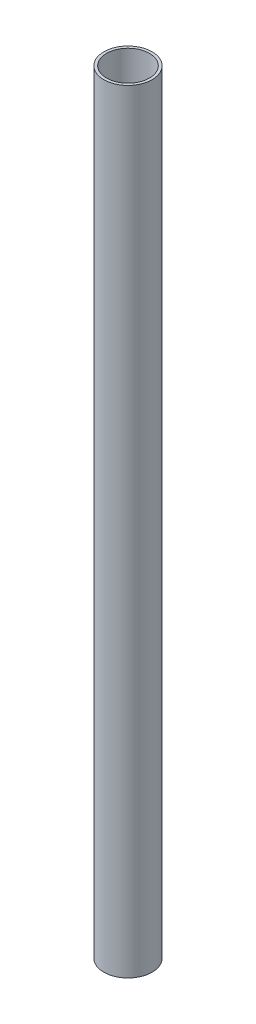
ISO-10303-21;
HEADER;
FILE_DESCRIPTION(('STEP AP214'),'2;1');
FILE_NAME('part.step','',(''),(''),'','','');
FILE_SCHEMA(('AUTOMOTIVE_DESIGN { 1 0 10303 214 1 1 1 1 }'));
ENDSEC;
DATA;
#1=APPLICATION_CONTEXT('core data for automotive mechanical design processes');
#2=APPLICATION_PROTOCOL_DEFINITION('international standard','automotive_design',2000,#1);
#3=PRODUCT_CONTEXT('',#1,'mechanical');
#4=PRODUCT('Part','Part','',(#3));
#5=PRODUCT_RELATED_PRODUCT_CATEGORY('part','',(#4));
#6=PRODUCT_DEFINITION_FORMATION('','',#4);
#7=PRODUCT_DEFINITION_CONTEXT('part definition',#1,'design');
#8=PRODUCT_DEFINITION('design','',#6,#7);
#9=PRODUCT_DEFINITION_SHAPE('','',#8);
#10=(LENGTH_UNIT() NAMED_UNIT(*) SI_UNIT(.MILLI.,.METRE.));
#11=(NAMED_UNIT(*) PLANE_ANGLE_UNIT() SI_UNIT($,.RADIAN.));
#12=(NAMED_UNIT(*) SI_UNIT($,.STERADIAN.) SOLID_ANGLE_UNIT());
#13=UNCERTAINTY_MEASURE_WITH_UNIT(LENGTH_MEASURE(1.E-05),#10,'distance_accuracy_value','');
#14=(GEOMETRIC_REPRESENTATION_CONTEXT(3) GLOBAL_UNCERTAINTY_ASSIGNED_CONTEXT((#13)) GLOBAL_UNIT_ASSIGNED_CONTEXT((#10,
#11,#12)) REPRESENTATION_CONTEXT('',''));
#15=CARTESIAN_POINT('',(0.,0.,0.));
#16=DIRECTION('',(0.,0.,1.));
#17=DIRECTION('',(1.,0.,0.));
#18=AXIS2_PLACEMENT_3D('',#15,#16,#17);
#19=CARTESIAN_POINT('',(0.,203.2,0.));
#20=DIRECTION('',(0.,1.,0.));
#21=DIRECTION('',(0.,0.,1.));
#22=AXIS2_PLACEMENT_3D('',#19,#20,#21);
#23=PLANE('',#22);
#24=CARTESIAN_POINT('',(0.,203.2,0.));
#25=DIRECTION('',(0.,1.,0.));
#26=DIRECTION('',(0.,0.,1.));
#27=AXIS2_PLACEMENT_3D('',#24,#25,#26);
#28=CIRCLE('',#27,6.35);
#29=CARTESIAN_POINT('',(0.,203.2,6.35));
#30=VERTEX_POINT('',#29);
#31=EDGE_CURVE('E10',#30,#30,#28,.T.);
#32=ORIENTED_EDGE('',*,*,#31,.T.);
#33=EDGE_LOOP('',(#32));
#34=FACE_BOUND('',#33,.T.);
#35=CARTESIAN_POINT('',(0.,203.2,0.));
#36=DIRECTION('',(0.,1.,0.));
#37=DIRECTION('',(0.,0.,1.));
#38=AXIS2_PLACEMENT_3D('',#35,#36,#37);
#39=CIRCLE('',#38,5.6388);
#40=CARTESIAN_POINT('',(0.,203.2,5.6388));
#41=VERTEX_POINT('',#40);
#42=EDGE_CURVE('E42',#41,#41,#39,.T.);
#43=ORIENTED_EDGE('',*,*,#42,.F.);
#44=EDGE_LOOP('',(#43));
#45=FACE_BOUND('',#44,.T.);
#46=ADVANCED_FACE('F31',(#34,#45),#23,.T.);
#47=CARTESIAN_POINT('',(0.,0.,0.));
#48=DIRECTION('',(0.,1.,0.));
#49=DIRECTION('',(0.,0.,1.));
#50=AXIS2_PLACEMENT_3D('',#47,#48,#49);
#51=PLANE('',#50);
#52=CARTESIAN_POINT('',(0.,0.,0.));
#53=DIRECTION('',(0.,1.,0.));
#54=DIRECTION('',(0.,0.,1.));
#55=AXIS2_PLACEMENT_3D('',#52,#53,#54);
#56=CIRCLE('',#55,6.35);
#57=CARTESIAN_POINT('',(0.,0.,6.35));
#58=VERTEX_POINT('',#57);
#59=EDGE_CURVE('E35',#58,#58,#56,.T.);
#60=ORIENTED_EDGE('',*,*,#59,.F.);
#61=EDGE_LOOP('',(#60));
#62=FACE_BOUND('',#61,.T.);
#63=CARTESIAN_POINT('',(0.,0.,0.));
#64=DIRECTION('',(0.,1.,0.));
#65=DIRECTION('',(0.,0.,1.));
#66=AXIS2_PLACEMENT_3D('',#63,#64,#65);
#67=CIRCLE('',#66,5.6388);
#68=CARTESIAN_POINT('',(0.,0.,5.6388));
#69=VERTEX_POINT('',#68);
#70=EDGE_CURVE('E44',#69,#69,#67,.T.);
#71=ORIENTED_EDGE('',*,*,#70,.T.);
#72=EDGE_LOOP('',(#71));
#73=FACE_BOUND('',#72,.T.);
#74=ADVANCED_FACE('F54',(#62,#73),#51,.F.);
#75=CARTESIAN_POINT('',(0.,203.2,0.));
#76=DIRECTION('',(0.,-1.,0.));
#77=DIRECTION('',(0.,0.,-1.));
#78=AXIS2_PLACEMENT_3D('',#75,#76,#77);
#79=CYLINDRICAL_SURFACE('',#78,6.35);
#80=ORIENTED_EDGE('',*,*,#31,.F.);
#81=EDGE_LOOP('',(#80));
#82=FACE_BOUND('',#81,.T.);
#83=ORIENTED_EDGE('',*,*,#59,.T.);
#84=EDGE_LOOP('',(#83));
#85=FACE_BOUND('',#84,.T.);
#86=ADVANCED_FACE('F33',(#82,#85),#79,.T.);
#87=CARTESIAN_POINT('',(0.,203.2,0.));
#88=DIRECTION('',(0.,-1.,0.));
#89=DIRECTION('',(0.,0.,-1.));
#90=AXIS2_PLACEMENT_3D('',#87,#88,#89);
#91=CYLINDRICAL_SURFACE('',#90,5.6388);
#92=ORIENTED_EDGE('',*,*,#42,.T.);
#93=EDGE_LOOP('',(#92));
#94=FACE_BOUND('',#93,.T.);
#95=ORIENTED_EDGE('',*,*,#70,.F.);
#96=EDGE_LOOP('',(#95));
#97=FACE_BOUND('',#96,.T.);
#98=ADVANCED_FACE('F50',(#94,#97),#91,.F.);
#99=CLOSED_SHELL('',(#46,#74,#86,#98));
#100=MANIFOLD_SOLID_BREP('B2',#99);
#101=ADVANCED_BREP_SHAPE_REPRESENTATION('',(#18,#100),#14);
#102=SHAPE_DEFINITION_REPRESENTATION(#9,#101);
ENDSEC;
END-ISO-10303-21;
